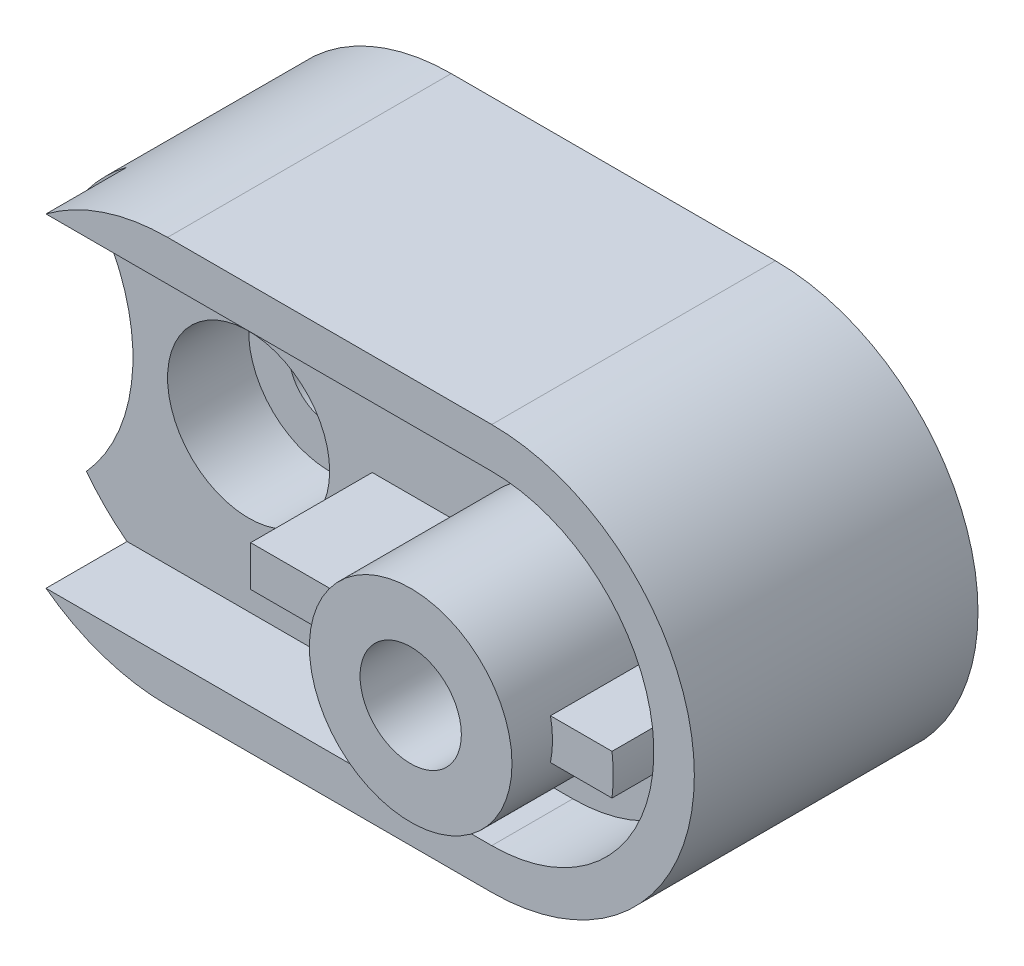
ISO-10303-21;
HEADER;
FILE_DESCRIPTION(('STEP AP214'),'2;1');
FILE_NAME('part.step','',(''),(''),'','','');
FILE_SCHEMA(('AUTOMOTIVE_DESIGN { 1 0 10303 214 1 1 1 1 }'));
ENDSEC;
DATA;
#1=APPLICATION_CONTEXT('core data for automotive mechanical design processes');
#2=APPLICATION_PROTOCOL_DEFINITION('international standard','automotive_design',2000,#1);
#3=PRODUCT_CONTEXT('',#1,'mechanical');
#4=PRODUCT('Part','Part','',(#3));
#5=PRODUCT_RELATED_PRODUCT_CATEGORY('part','',(#4));
#6=PRODUCT_DEFINITION_FORMATION('','',#4);
#7=PRODUCT_DEFINITION_CONTEXT('part definition',#1,'design');
#8=PRODUCT_DEFINITION('design','',#6,#7);
#9=PRODUCT_DEFINITION_SHAPE('','',#8);
#10=(LENGTH_UNIT() NAMED_UNIT(*) SI_UNIT(.MILLI.,.METRE.));
#11=(NAMED_UNIT(*) PLANE_ANGLE_UNIT() SI_UNIT($,.RADIAN.));
#12=(NAMED_UNIT(*) SI_UNIT($,.STERADIAN.) SOLID_ANGLE_UNIT());
#13=UNCERTAINTY_MEASURE_WITH_UNIT(LENGTH_MEASURE(1.E-05),#10,'distance_accuracy_value','');
#14=(GEOMETRIC_REPRESENTATION_CONTEXT(3) GLOBAL_UNCERTAINTY_ASSIGNED_CONTEXT((#13)) GLOBAL_UNIT_ASSIGNED_CONTEXT((#10,
#11,#12)) REPRESENTATION_CONTEXT('',''));
#15=CARTESIAN_POINT('',(0.,0.,0.));
#16=DIRECTION('',(0.,0.,1.));
#17=DIRECTION('',(1.,0.,0.));
#18=AXIS2_PLACEMENT_3D('',#15,#16,#17);
#19=CARTESIAN_POINT('',(0.,0.,50.));
#20=DIRECTION('',(0.,0.,1.));
#21=DIRECTION('',(1.,0.,0.));
#22=AXIS2_PLACEMENT_3D('',#19,#20,#21);
#23=PLANE('',#22);
#24=CARTESIAN_POINT('',(50.,50.,50.));
#25=DIRECTION('',(0.,0.,1.));
#26=DIRECTION('',(1.,0.,0.));
#27=AXIS2_PLACEMENT_3D('',#24,#25,#26);
#28=CIRCLE('',#27,20.);
#29=CARTESIAN_POINT('',(70.,50.,50.));
#30=VERTEX_POINT('',#29);
#31=EDGE_CURVE('E230',#30,#30,#28,.T.);
#32=ORIENTED_EDGE('',*,*,#31,.F.);
#33=EDGE_LOOP('',(#32));
#34=FACE_BOUND('',#33,.T.);
#35=CARTESIAN_POINT('',(130.,50.,50.));
#36=DIRECTION('',(0.,0.,1.));
#37=DIRECTION('',(1.,0.,0.));
#38=AXIS2_PLACEMENT_3D('',#35,#36,#37);
#39=CIRCLE('',#38,40.);
#40=CARTESIAN_POINT('',(169.686269665969,45.,50.));
#41=VERTEX_POINT('',#40);
#42=CARTESIAN_POINT('',(130.,9.99999999999999,50.));
#43=VERTEX_POINT('',#42);
#44=EDGE_CURVE('E249',#41,#43,#39,.F.);
#45=ORIENTED_EDGE('',*,*,#44,.F.);
#46=DIRECTION('',(1.,0.,0.));
#47=VECTOR('',#46,1.);
#48=CARTESIAN_POINT('',(0.,45.,50.));
#49=LINE('',#48,#47);
#50=CARTESIAN_POINT('',(154.494897427832,45.,50.));
#51=VERTEX_POINT('',#50);
#52=EDGE_CURVE('E193',#51,#41,#49,.T.);
#53=ORIENTED_EDGE('',*,*,#52,.F.);
#54=CARTESIAN_POINT('',(130.,50.,50.));
#55=DIRECTION('',(0.,0.,1.));
#56=DIRECTION('',(1.,0.,0.));
#57=AXIS2_PLACEMENT_3D('',#54,#55,#56);
#58=CIRCLE('',#57,25.);
#59=CARTESIAN_POINT('',(105.505102572168,45.,50.));
#60=VERTEX_POINT('',#59);
#61=EDGE_CURVE('E244',#60,#51,#58,.T.);
#62=ORIENTED_EDGE('',*,*,#61,.F.);
#63=DIRECTION('',(-1.,0.,0.));
#64=VECTOR('',#63,1.);
#65=CARTESIAN_POINT('',(0.,45.,50.));
#66=LINE('',#65,#64);
#67=CARTESIAN_POINT('',(80.5051025721682,45.,50.));
#68=VERTEX_POINT('',#67);
#69=EDGE_CURVE('E205',#60,#68,#66,.T.);
#70=ORIENTED_EDGE('',*,*,#69,.T.);
#71=DIRECTION('',(0.,-1.,0.));
#72=VECTOR('',#71,1.);
#73=CARTESIAN_POINT('',(80.5051025721682,0.,50.));
#74=LINE('',#73,#72);
#75=CARTESIAN_POINT('',(80.5051025721682,55.,50.));
#76=VERTEX_POINT('',#75);
#77=EDGE_CURVE('E212',#76,#68,#74,.T.);
#78=ORIENTED_EDGE('',*,*,#77,.F.);
#79=DIRECTION('',(-1.,0.,0.));
#80=VECTOR('',#79,1.);
#81=CARTESIAN_POINT('',(0.,55.,50.));
#82=LINE('',#81,#80);
#83=CARTESIAN_POINT('',(105.505102572168,55.,50.));
#84=VERTEX_POINT('',#83);
#85=EDGE_CURVE('E201',#84,#76,#82,.T.);
#86=ORIENTED_EDGE('',*,*,#85,.F.);
#87=CARTESIAN_POINT('',(154.494897427832,55.,50.));
#88=VERTEX_POINT('',#87);
#89=EDGE_CURVE('E239',#88,#84,#58,.T.);
#90=ORIENTED_EDGE('',*,*,#89,.F.);
#91=DIRECTION('',(1.,0.,0.));
#92=VECTOR('',#91,1.);
#93=CARTESIAN_POINT('',(0.,55.,50.));
#94=LINE('',#93,#92);
#95=CARTESIAN_POINT('',(169.686269665969,55.,50.));
#96=VERTEX_POINT('',#95);
#97=EDGE_CURVE('E195',#88,#96,#94,.T.);
#98=ORIENTED_EDGE('',*,*,#97,.T.);
#99=CARTESIAN_POINT('',(130.,90.,50.));
#100=VERTEX_POINT('',#99);
#101=EDGE_CURVE('E246',#100,#96,#39,.F.);
#102=ORIENTED_EDGE('',*,*,#101,.F.);
#103=DIRECTION('',(-1.,0.,0.));
#104=VECTOR('',#103,1.);
#105=CARTESIAN_POINT('',(0.,90.,50.));
#106=LINE('',#105,#104);
#107=CARTESIAN_POINT('',(20.,90.,50.));
#108=VERTEX_POINT('',#107);
#109=EDGE_CURVE('E248',#100,#108,#106,.T.);
#110=ORIENTED_EDGE('',*,*,#109,.T.);
#111=CARTESIAN_POINT('',(50.,50.,50.));
#112=DIRECTION('',(0.,0.,1.));
#113=DIRECTION('',(1.,0.,0.));
#114=AXIS2_PLACEMENT_3D('',#111,#112,#113);
#115=CIRCLE('',#114,50.);
#116=CARTESIAN_POINT('',(9.99999999999999,80.,50.));
#117=VERTEX_POINT('',#116);
#118=EDGE_CURVE('E252',#108,#117,#115,.T.);
#119=ORIENTED_EDGE('',*,*,#118,.T.);
#120=CARTESIAN_POINT('',(-23.5410196624968,50.,50.));
#121=DIRECTION('',(0.,0.,1.));
#122=DIRECTION('',(1.,0.,0.));
#123=AXIS2_PLACEMENT_3D('',#120,#121,#122);
#124=CIRCLE('',#123,45.);
#125=CARTESIAN_POINT('',(9.99999999999998,20.,50.));
#126=VERTEX_POINT('',#125);
#127=EDGE_CURVE('E254',#117,#126,#124,.F.);
#128=ORIENTED_EDGE('',*,*,#127,.T.);
#129=CARTESIAN_POINT('',(50.,50.,50.));
#130=DIRECTION('',(0.,0.,1.));
#131=DIRECTION('',(1.,0.,0.));
#132=AXIS2_PLACEMENT_3D('',#129,#130,#131);
#133=CIRCLE('',#132,50.);
#134=CARTESIAN_POINT('',(20.,9.99999999999999,50.));
#135=VERTEX_POINT('',#134);
#136=EDGE_CURVE('E256',#126,#135,#133,.T.);
#137=ORIENTED_EDGE('',*,*,#136,.T.);
#138=DIRECTION('',(-1.,0.,0.));
#139=VECTOR('',#138,1.);
#140=CARTESIAN_POINT('',(0.,9.99999999999999,50.));
#141=LINE('',#140,#139);
#142=EDGE_CURVE('E259',#43,#135,#141,.T.);
#143=ORIENTED_EDGE('',*,*,#142,.F.);
#144=EDGE_LOOP('',(#45,#53,#62,#70,#78,#86,#90,#98,#102,#110,#119,#128,#137,#143));
#145=FACE_BOUND('',#144,.T.);
#146=ADVANCED_FACE('F35',(#34,#145),#23,.T.);
#147=CARTESIAN_POINT('',(130.,50.,90.));
#148=DIRECTION('',(0.,0.,-1.));
#149=DIRECTION('',(-1.,0.,0.));
#150=AXIS2_PLACEMENT_3D('',#147,#148,#149);
#151=CYLINDRICAL_SURFACE('',#150,25.);
#152=CARTESIAN_POINT('',(130.,50.,90.));
#153=DIRECTION('',(0.,0.,1.));
#154=DIRECTION('',(1.,0.,0.));
#155=AXIS2_PLACEMENT_3D('',#152,#153,#154);
#156=CIRCLE('',#155,25.);
#157=CARTESIAN_POINT('',(155.,50.,90.));
#158=VERTEX_POINT('',#157);
#159=EDGE_CURVE('E240',#158,#158,#156,.T.);
#160=ORIENTED_EDGE('',*,*,#159,.F.);
#161=EDGE_LOOP('',(#160));
#162=FACE_BOUND('',#161,.T.);
#163=DIRECTION('',(0.,0.,-1.));
#164=VECTOR('',#163,1.);
#165=CARTESIAN_POINT('',(154.494897427832,45.,80.));
#166=LINE('',#165,#164);
#167=CARTESIAN_POINT('',(154.494897427832,45.,80.));
#168=VERTEX_POINT('',#167);
#169=EDGE_CURVE('E55',#168,#51,#166,.T.);
#170=ORIENTED_EDGE('',*,*,#169,.F.);
#171=CARTESIAN_POINT('',(130.,50.,80.));
#172=DIRECTION('',(0.,0.,1.));
#173=DIRECTION('',(1.,0.,0.));
#174=AXIS2_PLACEMENT_3D('',#171,#172,#173);
#175=CIRCLE('',#174,25.);
#176=CARTESIAN_POINT('',(154.494897427832,55.,80.));
#177=VERTEX_POINT('',#176);
#178=EDGE_CURVE('E50',#177,#168,#175,.F.);
#179=ORIENTED_EDGE('',*,*,#178,.F.);
#180=DIRECTION('',(0.,0.,-1.));
#181=VECTOR('',#180,1.);
#182=CARTESIAN_POINT('',(154.494897427832,55.,80.));
#183=LINE('',#182,#181);
#184=EDGE_CURVE('E189',#177,#88,#183,.T.);
#185=ORIENTED_EDGE('',*,*,#184,.T.);
#186=ORIENTED_EDGE('',*,*,#89,.T.);
#187=DIRECTION('',(0.,0.,-1.));
#188=VECTOR('',#187,1.);
#189=CARTESIAN_POINT('',(105.505102572168,55.,80.));
#190=LINE('',#189,#188);
#191=CARTESIAN_POINT('',(105.505102572168,55.,80.));
#192=VERTEX_POINT('',#191);
#193=EDGE_CURVE('E224',#192,#84,#190,.T.);
#194=ORIENTED_EDGE('',*,*,#193,.F.);
#195=CARTESIAN_POINT('',(130.,50.,80.));
#196=DIRECTION('',(0.,0.,1.));
#197=DIRECTION('',(1.,0.,0.));
#198=AXIS2_PLACEMENT_3D('',#195,#196,#197);
#199=CIRCLE('',#198,25.);
#200=CARTESIAN_POINT('',(105.505102572168,45.,80.));
#201=VERTEX_POINT('',#200);
#202=EDGE_CURVE('E331',#192,#201,#199,.T.);
#203=ORIENTED_EDGE('',*,*,#202,.T.);
#204=DIRECTION('',(0.,0.,-1.));
#205=VECTOR('',#204,1.);
#206=CARTESIAN_POINT('',(105.505102572168,45.,80.));
#207=LINE('',#206,#205);
#208=EDGE_CURVE('E210',#201,#60,#207,.T.);
#209=ORIENTED_EDGE('',*,*,#208,.T.);
#210=ORIENTED_EDGE('',*,*,#61,.T.);
#211=EDGE_LOOP('',(#170,#179,#185,#186,#194,#203,#209,#210));
#212=FACE_BOUND('',#211,.T.);
#213=ADVANCED_FACE('F390',(#162,#212),#151,.T.);
#214=CARTESIAN_POINT('',(130.,50.,50.));
#215=DIRECTION('',(0.,0.,1.));
#216=DIRECTION('',(1.,0.,0.));
#217=AXIS2_PLACEMENT_3D('',#214,#215,#216);
#218=CYLINDRICAL_SURFACE('',#217,40.);
#219=CARTESIAN_POINT('',(130.,50.,70.));
#220=DIRECTION('',(0.,0.,1.));
#221=DIRECTION('',(1.,0.,0.));
#222=AXIS2_PLACEMENT_3D('',#219,#220,#221);
#223=CIRCLE('',#222,40.);
#224=CARTESIAN_POINT('',(169.686269665969,45.,70.));
#225=VERTEX_POINT('',#224);
#226=CARTESIAN_POINT('',(130.,9.99999999999999,70.));
#227=VERTEX_POINT('',#226);
#228=EDGE_CURVE('E243',#225,#227,#223,.F.);
#229=ORIENTED_EDGE('',*,*,#228,.F.);
#230=DIRECTION('',(0.,0.,1.));
#231=VECTOR('',#230,1.);
#232=CARTESIAN_POINT('',(169.686269665969,45.,50.));
#233=LINE('',#232,#231);
#234=EDGE_CURVE('E11',#225,#41,#233,.F.);
#235=ORIENTED_EDGE('',*,*,#234,.T.);
#236=ORIENTED_EDGE('',*,*,#44,.T.);
#237=DIRECTION('',(0.,0.,1.));
#238=VECTOR('',#237,1.);
#239=CARTESIAN_POINT('',(130.,9.99999999999999,50.));
#240=LINE('',#239,#238);
#241=EDGE_CURVE('E274',#43,#227,#240,.T.);
#242=ORIENTED_EDGE('',*,*,#241,.T.);
#243=EDGE_LOOP('',(#229,#235,#236,#242));
#244=FACE_BOUND('',#243,.T.);
#245=ADVANCED_FACE('F357',(#244),#218,.F.);
#246=CARTESIAN_POINT('',(50.,50.,-36.));
#247=DIRECTION('',(0.,0.,1.));
#248=DIRECTION('',(1.,0.,0.));
#249=AXIS2_PLACEMENT_3D('',#246,#247,#248);
#250=CYLINDRICAL_SURFACE('',#249,10.);
#251=CARTESIAN_POINT('',(50.,50.,0.));
#252=DIRECTION('',(0.,0.,-1.));
#253=DIRECTION('',(-1.,0.,0.));
#254=AXIS2_PLACEMENT_3D('',#251,#252,#253);
#255=CIRCLE('',#254,10.);
#256=CARTESIAN_POINT('',(40.,50.,0.));
#257=VERTEX_POINT('',#256);
#258=EDGE_CURVE('E277',#257,#257,#255,.T.);
#259=ORIENTED_EDGE('',*,*,#258,.T.);
#260=EDGE_LOOP('',(#259));
#261=FACE_BOUND('',#260,.T.);
#262=CARTESIAN_POINT('',(50.,50.,30.));
#263=DIRECTION('',(0.,0.,1.));
#264=DIRECTION('',(1.,0.,0.));
#265=AXIS2_PLACEMENT_3D('',#262,#263,#264);
#266=CIRCLE('',#265,10.);
#267=CARTESIAN_POINT('',(60.,50.,30.));
#268=VERTEX_POINT('',#267);
#269=EDGE_CURVE('E227',#268,#268,#266,.T.);
#270=ORIENTED_EDGE('',*,*,#269,.T.);
#271=EDGE_LOOP('',(#270));
#272=FACE_BOUND('',#271,.T.);
#273=ADVANCED_FACE('F438',(#261,#272),#250,.F.);
#274=CARTESIAN_POINT('',(0.,0.,70.));
#275=DIRECTION('',(0.,0.,-1.));
#276=DIRECTION('',(-1.,0.,0.));
#277=AXIS2_PLACEMENT_3D('',#274,#275,#276);
#278=PLANE('',#277);
#279=DIRECTION('',(-1.,0.,0.));
#280=VECTOR('',#279,1.);
#281=CARTESIAN_POINT('',(0.,9.99999999999999,70.));
#282=LINE('',#281,#280);
#283=CARTESIAN_POINT('',(20.,9.99999999999999,70.));
#284=VERTEX_POINT('',#283);
#285=EDGE_CURVE('E271',#227,#284,#282,.T.);
#286=ORIENTED_EDGE('',*,*,#285,.T.);
#287=CARTESIAN_POINT('',(50.,50.,70.));
#288=DIRECTION('',(0.,0.,1.));
#289=DIRECTION('',(1.,0.,0.));
#290=AXIS2_PLACEMENT_3D('',#287,#288,#289);
#291=CIRCLE('',#290,50.);
#292=CARTESIAN_POINT('',(50.,0.,70.));
#293=VERTEX_POINT('',#292);
#294=EDGE_CURVE('E315',#284,#293,#291,.T.);
#295=ORIENTED_EDGE('',*,*,#294,.T.);
#296=DIRECTION('',(1.,0.,0.));
#297=VECTOR('',#296,1.);
#298=CARTESIAN_POINT('',(0.,0.,70.));
#299=LINE('',#298,#297);
#300=CARTESIAN_POINT('',(130.,0.,70.));
#301=VERTEX_POINT('',#300);
#302=EDGE_CURVE('E325',#293,#301,#299,.T.);
#303=ORIENTED_EDGE('',*,*,#302,.T.);
#304=CARTESIAN_POINT('',(130.,50.,70.));
#305=DIRECTION('',(0.,0.,1.));
#306=DIRECTION('',(1.,0.,0.));
#307=AXIS2_PLACEMENT_3D('',#304,#305,#306);
#308=CIRCLE('',#307,50.);
#309=CARTESIAN_POINT('',(130.,100.,70.));
#310=VERTEX_POINT('',#309);
#311=EDGE_CURVE('E304',#310,#301,#308,.F.);
#312=ORIENTED_EDGE('',*,*,#311,.F.);
#313=DIRECTION('',(-1.,0.,0.));
#314=VECTOR('',#313,1.);
#315=CARTESIAN_POINT('',(0.,100.,70.));
#316=LINE('',#315,#314);
#317=CARTESIAN_POINT('',(50.,100.,70.));
#318=VERTEX_POINT('',#317);
#319=EDGE_CURVE('E328',#310,#318,#316,.T.);
#320=ORIENTED_EDGE('',*,*,#319,.T.);
#321=CARTESIAN_POINT('',(20.,90.,70.));
#322=VERTEX_POINT('',#321);
#323=EDGE_CURVE('E319',#318,#322,#291,.T.);
#324=ORIENTED_EDGE('',*,*,#323,.T.);
#325=DIRECTION('',(-1.,0.,0.));
#326=VECTOR('',#325,1.);
#327=CARTESIAN_POINT('',(0.,90.,70.));
#328=LINE('',#327,#326);
#329=CARTESIAN_POINT('',(130.,90.,70.));
#330=VERTEX_POINT('',#329);
#331=EDGE_CURVE('E268',#330,#322,#328,.T.);
#332=ORIENTED_EDGE('',*,*,#331,.F.);
#333=CARTESIAN_POINT('',(169.686269665969,55.,70.));
#334=VERTEX_POINT('',#333);
#335=EDGE_CURVE('E265',#330,#334,#223,.F.);
#336=ORIENTED_EDGE('',*,*,#335,.T.);
#337=EDGE_CURVE('E269',#334,#225,#223,.F.);
#338=ORIENTED_EDGE('',*,*,#337,.T.);
#339=ORIENTED_EDGE('',*,*,#228,.T.);
#340=EDGE_LOOP('',(#286,#295,#303,#312,#320,#324,#332,#336,#338,#339));
#341=FACE_BOUND('',#340,.T.);
#342=ADVANCED_FACE('F349',(#341),#278,.F.);
#343=CARTESIAN_POINT('',(50.,50.,0.));
#344=DIRECTION('',(0.,0.,1.));
#345=DIRECTION('',(1.,0.,0.));
#346=AXIS2_PLACEMENT_3D('',#343,#344,#345);
#347=CYLINDRICAL_SURFACE('',#346,50.);
#348=ORIENTED_EDGE('',*,*,#294,.F.);
#349=DIRECTION('',(0.,0.,1.));
#350=VECTOR('',#349,1.);
#351=CARTESIAN_POINT('',(20.,9.99999999999999,50.));
#352=LINE('',#351,#350);
#353=EDGE_CURVE('E278',#135,#284,#352,.T.);
#354=ORIENTED_EDGE('',*,*,#353,.F.);
#355=ORIENTED_EDGE('',*,*,#136,.F.);
#356=DIRECTION('',(0.,0.,1.));
#357=VECTOR('',#356,1.);
#358=CARTESIAN_POINT('',(9.99999999999998,20.,20.));
#359=LINE('',#358,#357);
#360=CARTESIAN_POINT('',(9.99999999999998,20.,20.));
#361=VERTEX_POINT('',#360);
#362=EDGE_CURVE('E293',#361,#126,#359,.T.);
#363=ORIENTED_EDGE('',*,*,#362,.F.);
#364=CARTESIAN_POINT('',(50.,50.,20.));
#365=DIRECTION('',(0.,0.,1.));
#366=DIRECTION('',(1.,0.,0.));
#367=AXIS2_PLACEMENT_3D('',#364,#365,#366);
#368=CIRCLE('',#367,50.);
#369=CARTESIAN_POINT('',(9.99999999999999,80.,20.));
#370=VERTEX_POINT('',#369);
#371=EDGE_CURVE('E286',#370,#361,#368,.T.);
#372=ORIENTED_EDGE('',*,*,#371,.F.);
#373=DIRECTION('',(0.,0.,1.));
#374=VECTOR('',#373,1.);
#375=CARTESIAN_POINT('',(9.99999999999999,80.,20.));
#376=LINE('',#375,#374);
#377=EDGE_CURVE('E292',#370,#117,#376,.T.);
#378=ORIENTED_EDGE('',*,*,#377,.T.);
#379=ORIENTED_EDGE('',*,*,#118,.F.);
#380=DIRECTION('',(0.,0.,1.));
#381=VECTOR('',#380,1.);
#382=CARTESIAN_POINT('',(20.,90.,50.));
#383=LINE('',#382,#381);
#384=EDGE_CURVE('E280',#108,#322,#383,.T.);
#385=ORIENTED_EDGE('',*,*,#384,.T.);
#386=ORIENTED_EDGE('',*,*,#323,.F.);
#387=DIRECTION('',(0.,0.,1.));
#388=VECTOR('',#387,1.);
#389=CARTESIAN_POINT('',(50.,100.,0.));
#390=LINE('',#389,#388);
#391=CARTESIAN_POINT('',(50.,100.,0.));
#392=VERTEX_POINT('',#391);
#393=EDGE_CURVE('E318',#392,#318,#390,.T.);
#394=ORIENTED_EDGE('',*,*,#393,.F.);
#395=CARTESIAN_POINT('',(50.,50.,0.));
#396=DIRECTION('',(0.,0.,1.));
#397=DIRECTION('',(1.,0.,0.));
#398=AXIS2_PLACEMENT_3D('',#395,#396,#397);
#399=CIRCLE('',#398,50.);
#400=CARTESIAN_POINT('',(50.,0.,0.));
#401=VERTEX_POINT('',#400);
#402=EDGE_CURVE('E316',#392,#401,#399,.T.);
#403=ORIENTED_EDGE('',*,*,#402,.T.);
#404=DIRECTION('',(0.,0.,1.));
#405=VECTOR('',#404,1.);
#406=CARTESIAN_POINT('',(50.,0.,0.));
#407=LINE('',#406,#405);
#408=EDGE_CURVE('E312',#401,#293,#407,.T.);
#409=ORIENTED_EDGE('',*,*,#408,.T.);
#410=EDGE_LOOP('',(#348,#354,#355,#363,#372,#378,#379,#385,#386,#394,#403,#409));
#411=FACE_BOUND('',#410,.T.);
#412=ADVANCED_FACE('F365',(#411),#347,.T.);
#413=CARTESIAN_POINT('',(-23.5410196624968,50.,20.));
#414=DIRECTION('',(0.,0.,1.));
#415=DIRECTION('',(1.,0.,0.));
#416=AXIS2_PLACEMENT_3D('',#413,#414,#415);
#417=CYLINDRICAL_SURFACE('',#416,45.);
#418=ORIENTED_EDGE('',*,*,#362,.T.);
#419=ORIENTED_EDGE('',*,*,#127,.F.);
#420=ORIENTED_EDGE('',*,*,#377,.F.);
#421=CARTESIAN_POINT('',(-23.5410196624968,50.,20.));
#422=DIRECTION('',(0.,0.,1.));
#423=DIRECTION('',(1.,0.,0.));
#424=AXIS2_PLACEMENT_3D('',#421,#422,#423);
#425=CIRCLE('',#424,45.);
#426=EDGE_CURVE('E284',#370,#361,#425,.F.);
#427=ORIENTED_EDGE('',*,*,#426,.T.);
#428=EDGE_LOOP('',(#418,#419,#420,#427));
#429=FACE_BOUND('',#428,.T.);
#430=ADVANCED_FACE('F445',(#429),#417,.F.);
#431=CARTESIAN_POINT('',(9.99999999999997,50.,0.));
#432=DIRECTION('',(0.,0.,1.));
#433=DIRECTION('',(1.,0.,0.));
#434=AXIS2_PLACEMENT_3D('',#431,#432,#433);
#435=CYLINDRICAL_SURFACE('',#434,5.);
#436=CARTESIAN_POINT('',(9.99999999999997,50.,0.));
#437=DIRECTION('',(0.,0.,1.));
#438=DIRECTION('',(1.,0.,0.));
#439=AXIS2_PLACEMENT_3D('',#436,#437,#438);
#440=CIRCLE('',#439,5.);
#441=CARTESIAN_POINT('',(15.,50.,0.));
#442=VERTEX_POINT('',#441);
#443=EDGE_CURVE('E296',#442,#442,#440,.T.);
#444=ORIENTED_EDGE('',*,*,#443,.F.);
#445=EDGE_LOOP('',(#444));
#446=FACE_BOUND('',#445,.T.);
#447=CARTESIAN_POINT('',(9.99999999999997,50.,20.));
#448=DIRECTION('',(0.,0.,1.));
#449=DIRECTION('',(1.,0.,0.));
#450=AXIS2_PLACEMENT_3D('',#447,#448,#449);
#451=CIRCLE('',#450,5.);
#452=CARTESIAN_POINT('',(15.,50.,20.));
#453=VERTEX_POINT('',#452);
#454=EDGE_CURVE('E289',#453,#453,#451,.F.);
#455=ORIENTED_EDGE('',*,*,#454,.F.);
#456=EDGE_LOOP('',(#455));
#457=FACE_BOUND('',#456,.T.);
#458=ADVANCED_FACE('F448',(#446,#457),#435,.F.);
#459=CARTESIAN_POINT('',(0.,0.,70.));
#460=DIRECTION('',(0.,1.,0.));
#461=DIRECTION('',(0.,0.,1.));
#462=AXIS2_PLACEMENT_3D('',#459,#460,#461);
#463=PLANE('',#462);
#464=DIRECTION('',(0.,0.,1.));
#465=VECTOR('',#464,1.);
#466=CARTESIAN_POINT('',(130.,0.,0.));
#467=LINE('',#466,#465);
#468=CARTESIAN_POINT('',(130.,0.,0.));
#469=VERTEX_POINT('',#468);
#470=EDGE_CURVE('E308',#469,#301,#467,.T.);
#471=ORIENTED_EDGE('',*,*,#470,.T.);
#472=ORIENTED_EDGE('',*,*,#302,.F.);
#473=ORIENTED_EDGE('',*,*,#408,.F.);
#474=DIRECTION('',(1.,0.,0.));
#475=VECTOR('',#474,1.);
#476=CARTESIAN_POINT('',(0.,0.,0.));
#477=LINE('',#476,#475);
#478=EDGE_CURVE('E324',#401,#469,#477,.T.);
#479=ORIENTED_EDGE('',*,*,#478,.T.);
#480=EDGE_LOOP('',(#471,#472,#473,#479));
#481=FACE_BOUND('',#480,.T.);
#482=ADVANCED_FACE('F37',(#481),#463,.F.);
#483=CARTESIAN_POINT('',(0.,0.,0.));
#484=DIRECTION('',(0.,0.,-1.));
#485=DIRECTION('',(-1.,0.,0.));
#486=AXIS2_PLACEMENT_3D('',#483,#484,#485);
#487=PLANE('',#486);
#488=ORIENTED_EDGE('',*,*,#258,.F.);
#489=EDGE_LOOP('',(#488));
#490=FACE_BOUND('',#489,.T.);
#491=ORIENTED_EDGE('',*,*,#443,.T.);
#492=EDGE_LOOP('',(#491));
#493=FACE_BOUND('',#492,.T.);
#494=DIRECTION('',(-1.,0.,0.));
#495=VECTOR('',#494,1.);
#496=CARTESIAN_POINT('',(0.,100.,0.));
#497=LINE('',#496,#495);
#498=CARTESIAN_POINT('',(130.,100.,0.));
#499=VERTEX_POINT('',#498);
#500=EDGE_CURVE('E329',#499,#392,#497,.T.);
#501=ORIENTED_EDGE('',*,*,#500,.F.);
#502=CARTESIAN_POINT('',(130.,50.,0.));
#503=DIRECTION('',(0.,0.,1.));
#504=DIRECTION('',(1.,0.,0.));
#505=AXIS2_PLACEMENT_3D('',#502,#503,#504);
#506=CIRCLE('',#505,50.);
#507=EDGE_CURVE('E305',#499,#469,#506,.F.);
#508=ORIENTED_EDGE('',*,*,#507,.T.);
#509=ORIENTED_EDGE('',*,*,#478,.F.);
#510=ORIENTED_EDGE('',*,*,#402,.F.);
#511=EDGE_LOOP('',(#501,#508,#509,#510));
#512=FACE_BOUND('',#511,.T.);
#513=ADVANCED_FACE('F375',(#490,#493,#512),#487,.T.);
#514=CARTESIAN_POINT('',(0.,100.,70.));
#515=DIRECTION('',(0.,-1.,0.));
#516=DIRECTION('',(0.,0.,-1.));
#517=AXIS2_PLACEMENT_3D('',#514,#515,#516);
#518=PLANE('',#517);
#519=ORIENTED_EDGE('',*,*,#319,.F.);
#520=DIRECTION('',(0.,0.,1.));
#521=VECTOR('',#520,1.);
#522=CARTESIAN_POINT('',(130.,100.,0.));
#523=LINE('',#522,#521);
#524=EDGE_CURVE('E301',#499,#310,#523,.T.);
#525=ORIENTED_EDGE('',*,*,#524,.F.);
#526=ORIENTED_EDGE('',*,*,#500,.T.);
#527=ORIENTED_EDGE('',*,*,#393,.T.);
#528=EDGE_LOOP('',(#519,#525,#526,#527));
#529=FACE_BOUND('',#528,.T.);
#530=ADVANCED_FACE('F380',(#529),#518,.F.);
#531=CARTESIAN_POINT('',(130.,50.,0.));
#532=DIRECTION('',(0.,0.,1.));
#533=DIRECTION('',(1.,0.,0.));
#534=AXIS2_PLACEMENT_3D('',#531,#532,#533);
#535=CYLINDRICAL_SURFACE('',#534,50.);
#536=ORIENTED_EDGE('',*,*,#311,.T.);
#537=ORIENTED_EDGE('',*,*,#470,.F.);
#538=ORIENTED_EDGE('',*,*,#507,.F.);
#539=ORIENTED_EDGE('',*,*,#524,.T.);
#540=EDGE_LOOP('',(#536,#537,#538,#539));
#541=FACE_BOUND('',#540,.T.);
#542=ADVANCED_FACE('F371',(#541),#535,.T.);
#543=CARTESIAN_POINT('',(0.,0.,20.));
#544=DIRECTION('',(0.,0.,1.));
#545=DIRECTION('',(1.,0.,0.));
#546=AXIS2_PLACEMENT_3D('',#543,#544,#545);
#547=PLANE('',#546);
#548=ORIENTED_EDGE('',*,*,#426,.F.);
#549=ORIENTED_EDGE('',*,*,#371,.T.);
#550=EDGE_LOOP('',(#548,#549));
#551=FACE_BOUND('',#550,.T.);
#552=ORIENTED_EDGE('',*,*,#454,.T.);
#553=EDGE_LOOP('',(#552));
#554=FACE_BOUND('',#553,.T.);
#555=ADVANCED_FACE('F431',(#551,#554),#547,.T.);
#556=DIRECTION('',(0.,0.,1.));
#557=VECTOR('',#556,1.);
#558=CARTESIAN_POINT('',(169.686269665969,55.,50.));
#559=LINE('',#558,#557);
#560=EDGE_CURVE('E43',#334,#96,#559,.F.);
#561=ORIENTED_EDGE('',*,*,#560,.F.);
#562=ORIENTED_EDGE('',*,*,#335,.F.);
#563=DIRECTION('',(0.,0.,1.));
#564=VECTOR('',#563,1.);
#565=CARTESIAN_POINT('',(130.,90.,50.));
#566=LINE('',#565,#564);
#567=EDGE_CURVE('E264',#100,#330,#566,.T.);
#568=ORIENTED_EDGE('',*,*,#567,.F.);
#569=ORIENTED_EDGE('',*,*,#101,.T.);
#570=EDGE_LOOP('',(#561,#562,#568,#569));
#571=FACE_BOUND('',#570,.T.);
#572=ADVANCED_FACE('F344',(#571),#218,.F.);
#573=CARTESIAN_POINT('',(0.,9.99999999999999,50.));
#574=DIRECTION('',(0.,1.,0.));
#575=DIRECTION('',(0.,0.,1.));
#576=AXIS2_PLACEMENT_3D('',#573,#574,#575);
#577=PLANE('',#576);
#578=ORIENTED_EDGE('',*,*,#285,.F.);
#579=ORIENTED_EDGE('',*,*,#241,.F.);
#580=ORIENTED_EDGE('',*,*,#142,.T.);
#581=ORIENTED_EDGE('',*,*,#353,.T.);
#582=EDGE_LOOP('',(#578,#579,#580,#581));
#583=FACE_BOUND('',#582,.T.);
#584=ADVANCED_FACE('F355',(#583),#577,.T.);
#585=CARTESIAN_POINT('',(0.,90.,50.));
#586=DIRECTION('',(0.,1.,0.));
#587=DIRECTION('',(0.,0.,1.));
#588=AXIS2_PLACEMENT_3D('',#585,#586,#587);
#589=PLANE('',#588);
#590=ORIENTED_EDGE('',*,*,#331,.T.);
#591=ORIENTED_EDGE('',*,*,#384,.F.);
#592=ORIENTED_EDGE('',*,*,#109,.F.);
#593=ORIENTED_EDGE('',*,*,#567,.T.);
#594=EDGE_LOOP('',(#590,#591,#592,#593));
#595=FACE_BOUND('',#594,.T.);
#596=ADVANCED_FACE('F385',(#595),#589,.F.);
#597=CARTESIAN_POINT('',(130.,50.,90.));
#598=DIRECTION('',(0.,0.,1.));
#599=DIRECTION('',(1.,0.,0.));
#600=AXIS2_PLACEMENT_3D('',#597,#598,#599);
#601=PLANE('',#600);
#602=ORIENTED_EDGE('',*,*,#159,.T.);
#603=EDGE_LOOP('',(#602));
#604=FACE_BOUND('',#603,.T.);
#605=CARTESIAN_POINT('',(130.,50.,90.));
#606=DIRECTION('',(0.,0.,1.));
#607=DIRECTION('',(1.,0.,0.));
#608=AXIS2_PLACEMENT_3D('',#605,#606,#607);
#609=CIRCLE('',#608,12.5);
#610=CARTESIAN_POINT('',(142.5,50.,90.));
#611=VERTEX_POINT('',#610);
#612=EDGE_CURVE('E234',#611,#611,#609,.T.);
#613=ORIENTED_EDGE('',*,*,#612,.F.);
#614=EDGE_LOOP('',(#613));
#615=FACE_BOUND('',#614,.T.);
#616=ADVANCED_FACE('F428',(#604,#615),#601,.T.);
#617=CARTESIAN_POINT('',(130.,50.,90.));
#618=DIRECTION('',(0.,0.,-1.));
#619=DIRECTION('',(-1.,0.,0.));
#620=AXIS2_PLACEMENT_3D('',#617,#618,#619);
#621=CYLINDRICAL_SURFACE('',#620,12.5);
#622=ORIENTED_EDGE('',*,*,#612,.T.);
#623=EDGE_LOOP('',(#622));
#624=FACE_BOUND('',#623,.T.);
#625=CARTESIAN_POINT('',(130.,50.,50.));
#626=DIRECTION('',(0.,0.,1.));
#627=DIRECTION('',(1.,0.,0.));
#628=AXIS2_PLACEMENT_3D('',#625,#626,#627);
#629=CIRCLE('',#628,12.5);
#630=CARTESIAN_POINT('',(142.5,50.,50.));
#631=VERTEX_POINT('',#630);
#632=EDGE_CURVE('E261',#631,#631,#629,.F.);
#633=ORIENTED_EDGE('',*,*,#632,.T.);
#634=EDGE_LOOP('',(#633));
#635=FACE_BOUND('',#634,.T.);
#636=ADVANCED_FACE('F436',(#624,#635),#621,.F.);
#637=CARTESIAN_POINT('',(130.,50.,50.));
#638=DIRECTION('',(0.,0.,1.));
#639=DIRECTION('',(1.,0.,0.));
#640=AXIS2_PLACEMENT_3D('',#637,#638,#639);
#641=CONICAL_SURFACE('',#640,12.5,1.02974425867665);
#642=CARTESIAN_POINT('',(130.,50.,42.4892422621555));
#643=VERTEX_POINT('',#642);
#644=VERTEX_LOOP('',#643);
#645=FACE_BOUND('',#644,.T.);
#646=ORIENTED_EDGE('',*,*,#632,.F.);
#647=EDGE_LOOP('',(#646));
#648=FACE_BOUND('',#647,.T.);
#649=ADVANCED_FACE('F432',(#645,#648),#641,.F.);
#650=CARTESIAN_POINT('',(50.,50.,30.));
#651=DIRECTION('',(0.,0.,1.));
#652=DIRECTION('',(1.,0.,0.));
#653=AXIS2_PLACEMENT_3D('',#650,#651,#652);
#654=CYLINDRICAL_SURFACE('',#653,20.);
#655=CARTESIAN_POINT('',(50.,50.,30.));
#656=DIRECTION('',(0.,0.,1.));
#657=DIRECTION('',(1.,0.,0.));
#658=AXIS2_PLACEMENT_3D('',#655,#656,#657);
#659=CIRCLE('',#658,20.);
#660=CARTESIAN_POINT('',(70.,50.,30.));
#661=VERTEX_POINT('',#660);
#662=EDGE_CURVE('E231',#661,#661,#659,.T.);
#663=ORIENTED_EDGE('',*,*,#662,.F.);
#664=EDGE_LOOP('',(#663));
#665=FACE_BOUND('',#664,.T.);
#666=ORIENTED_EDGE('',*,*,#31,.T.);
#667=EDGE_LOOP('',(#666));
#668=FACE_BOUND('',#667,.T.);
#669=ADVANCED_FACE('F435',(#665,#668),#654,.F.);
#670=CARTESIAN_POINT('',(50.,50.,30.));
#671=DIRECTION('',(0.,0.,1.));
#672=DIRECTION('',(1.,0.,0.));
#673=AXIS2_PLACEMENT_3D('',#670,#671,#672);
#674=PLANE('',#673);
#675=ORIENTED_EDGE('',*,*,#269,.F.);
#676=EDGE_LOOP('',(#675));
#677=FACE_BOUND('',#676,.T.);
#678=ORIENTED_EDGE('',*,*,#662,.T.);
#679=EDGE_LOOP('',(#678));
#680=FACE_BOUND('',#679,.T.);
#681=ADVANCED_FACE('F517',(#677,#680),#674,.T.);
#682=CARTESIAN_POINT('',(0.,0.,80.));
#683=DIRECTION('',(0.,0.,1.));
#684=DIRECTION('',(1.,0.,0.));
#685=AXIS2_PLACEMENT_3D('',#682,#683,#684);
#686=PLANE('',#685);
#687=ORIENTED_EDGE('',*,*,#202,.F.);
#688=DIRECTION('',(-1.,0.,0.));
#689=VECTOR('',#688,1.);
#690=CARTESIAN_POINT('',(0.,55.,80.));
#691=LINE('',#690,#689);
#692=CARTESIAN_POINT('',(80.5051025721682,55.,80.));
#693=VERTEX_POINT('',#692);
#694=EDGE_CURVE('E202',#192,#693,#691,.T.);
#695=ORIENTED_EDGE('',*,*,#694,.T.);
#696=DIRECTION('',(0.,-1.,0.));
#697=VECTOR('',#696,1.);
#698=CARTESIAN_POINT('',(80.5051025721682,0.,80.));
#699=LINE('',#698,#697);
#700=CARTESIAN_POINT('',(80.5051025721682,45.,80.));
#701=VERTEX_POINT('',#700);
#702=EDGE_CURVE('E204',#693,#701,#699,.T.);
#703=ORIENTED_EDGE('',*,*,#702,.T.);
#704=DIRECTION('',(-1.,0.,0.));
#705=VECTOR('',#704,1.);
#706=CARTESIAN_POINT('',(0.,45.,80.));
#707=LINE('',#706,#705);
#708=EDGE_CURVE('E207',#201,#701,#707,.T.);
#709=ORIENTED_EDGE('',*,*,#708,.F.);
#710=EDGE_LOOP('',(#687,#695,#703,#709));
#711=FACE_BOUND('',#710,.T.);
#712=ADVANCED_FACE('F397',(#711),#686,.T.);
#713=CARTESIAN_POINT('',(0.,55.,80.));
#714=DIRECTION('',(0.,-1.,0.));
#715=DIRECTION('',(1.,0.,0.));
#716=AXIS2_PLACEMENT_3D('',#713,#714,#715);
#717=PLANE('',#716);
#718=ORIENTED_EDGE('',*,*,#85,.T.);
#719=DIRECTION('',(0.,0.,-1.));
#720=VECTOR('',#719,1.);
#721=CARTESIAN_POINT('',(80.5051025721682,55.,80.));
#722=LINE('',#721,#720);
#723=EDGE_CURVE('E221',#693,#76,#722,.T.);
#724=ORIENTED_EDGE('',*,*,#723,.F.);
#725=ORIENTED_EDGE('',*,*,#694,.F.);
#726=ORIENTED_EDGE('',*,*,#193,.T.);
#727=EDGE_LOOP('',(#718,#724,#725,#726));
#728=FACE_BOUND('',#727,.T.);
#729=ADVANCED_FACE('F393',(#728),#717,.F.);
#730=CARTESIAN_POINT('',(80.5051025721682,0.,80.));
#731=DIRECTION('',(1.,0.,0.));
#732=DIRECTION('',(0.,0.,-1.));
#733=AXIS2_PLACEMENT_3D('',#730,#731,#732);
#734=PLANE('',#733);
#735=ORIENTED_EDGE('',*,*,#77,.T.);
#736=DIRECTION('',(0.,0.,-1.));
#737=VECTOR('',#736,1.);
#738=CARTESIAN_POINT('',(80.5051025721682,45.,80.));
#739=LINE('',#738,#737);
#740=EDGE_CURVE('E219',#701,#68,#739,.T.);
#741=ORIENTED_EDGE('',*,*,#740,.F.);
#742=ORIENTED_EDGE('',*,*,#702,.F.);
#743=ORIENTED_EDGE('',*,*,#723,.T.);
#744=EDGE_LOOP('',(#735,#741,#742,#743));
#745=FACE_BOUND('',#744,.T.);
#746=ADVANCED_FACE('F404',(#745),#734,.F.);
#747=CARTESIAN_POINT('',(0.,45.,80.));
#748=DIRECTION('',(0.,-1.,0.));
#749=DIRECTION('',(1.,0.,0.));
#750=AXIS2_PLACEMENT_3D('',#747,#748,#749);
#751=PLANE('',#750);
#752=ORIENTED_EDGE('',*,*,#69,.F.);
#753=ORIENTED_EDGE('',*,*,#208,.F.);
#754=ORIENTED_EDGE('',*,*,#708,.T.);
#755=ORIENTED_EDGE('',*,*,#740,.T.);
#756=EDGE_LOOP('',(#752,#753,#754,#755));
#757=FACE_BOUND('',#756,.T.);
#758=ADVANCED_FACE('F402',(#757),#751,.T.);
#759=CARTESIAN_POINT('',(130.,50.,80.));
#760=DIRECTION('',(0.,0.,-1.));
#761=DIRECTION('',(-1.,0.,0.));
#762=AXIS2_PLACEMENT_3D('',#759,#760,#761);
#763=CYLINDRICAL_SURFACE('',#762,40.);
#764=DIRECTION('',(0.,0.,-1.));
#765=VECTOR('',#764,1.);
#766=CARTESIAN_POINT('',(169.686269665969,45.,80.));
#767=LINE('',#766,#765);
#768=CARTESIAN_POINT('',(169.686269665969,45.,80.));
#769=VERTEX_POINT('',#768);
#770=EDGE_CURVE('E177',#769,#225,#767,.T.);
#771=ORIENTED_EDGE('',*,*,#770,.T.);
#772=ORIENTED_EDGE('',*,*,#337,.F.);
#773=DIRECTION('',(0.,0.,-1.));
#774=VECTOR('',#773,1.);
#775=CARTESIAN_POINT('',(169.686269665969,55.,80.));
#776=LINE('',#775,#774);
#777=CARTESIAN_POINT('',(169.686269665969,55.,80.));
#778=VERTEX_POINT('',#777);
#779=EDGE_CURVE('E182',#778,#334,#776,.T.);
#780=ORIENTED_EDGE('',*,*,#779,.F.);
#781=CARTESIAN_POINT('',(130.,50.,80.));
#782=DIRECTION('',(0.,0.,1.));
#783=DIRECTION('',(1.,0.,0.));
#784=AXIS2_PLACEMENT_3D('',#781,#782,#783);
#785=CIRCLE('',#784,40.);
#786=EDGE_CURVE('E171',#769,#778,#785,.T.);
#787=ORIENTED_EDGE('',*,*,#786,.F.);
#788=EDGE_LOOP('',(#771,#772,#780,#787));
#789=FACE_BOUND('',#788,.T.);
#790=ADVANCED_FACE('F184',(#789),#763,.T.);
#791=CARTESIAN_POINT('',(0.,45.,80.));
#792=DIRECTION('',(0.,1.,0.));
#793=DIRECTION('',(0.,0.,1.));
#794=AXIS2_PLACEMENT_3D('',#791,#792,#793);
#795=PLANE('',#794);
#796=ORIENTED_EDGE('',*,*,#52,.T.);
#797=ORIENTED_EDGE('',*,*,#234,.F.);
#798=ORIENTED_EDGE('',*,*,#770,.F.);
#799=DIRECTION('',(1.,0.,0.));
#800=VECTOR('',#799,1.);
#801=CARTESIAN_POINT('',(0.,45.,80.));
#802=LINE('',#801,#800);
#803=EDGE_CURVE('E166',#168,#769,#802,.T.);
#804=ORIENTED_EDGE('',*,*,#803,.F.);
#805=ORIENTED_EDGE('',*,*,#169,.T.);
#806=EDGE_LOOP('',(#796,#797,#798,#804,#805));
#807=FACE_BOUND('',#806,.T.);
#808=ADVANCED_FACE('F179',(#807),#795,.F.);
#809=CARTESIAN_POINT('',(0.,55.,80.));
#810=DIRECTION('',(0.,1.,0.));
#811=DIRECTION('',(0.,0.,1.));
#812=AXIS2_PLACEMENT_3D('',#809,#810,#811);
#813=PLANE('',#812);
#814=ORIENTED_EDGE('',*,*,#97,.F.);
#815=ORIENTED_EDGE('',*,*,#184,.F.);
#816=DIRECTION('',(1.,0.,0.));
#817=VECTOR('',#816,1.);
#818=CARTESIAN_POINT('',(0.,55.,80.));
#819=LINE('',#818,#817);
#820=EDGE_CURVE('E187',#177,#778,#819,.T.);
#821=ORIENTED_EDGE('',*,*,#820,.T.);
#822=ORIENTED_EDGE('',*,*,#779,.T.);
#823=ORIENTED_EDGE('',*,*,#560,.T.);
#824=EDGE_LOOP('',(#814,#815,#821,#822,#823));
#825=FACE_BOUND('',#824,.T.);
#826=ADVANCED_FACE('F341',(#825),#813,.T.);
#827=CARTESIAN_POINT('',(0.,0.,80.));
#828=DIRECTION('',(0.,0.,1.));
#829=DIRECTION('',(1.,0.,0.));
#830=AXIS2_PLACEMENT_3D('',#827,#828,#829);
#831=PLANE('',#830);
#832=ORIENTED_EDGE('',*,*,#178,.T.);
#833=ORIENTED_EDGE('',*,*,#803,.T.);
#834=ORIENTED_EDGE('',*,*,#786,.T.);
#835=ORIENTED_EDGE('',*,*,#820,.F.);
#836=EDGE_LOOP('',(#832,#833,#834,#835));
#837=FACE_BOUND('',#836,.T.);
#838=ADVANCED_FACE('F168',(#837),#831,.T.);
#839=CLOSED_SHELL('',(#146,#213,#245,#273,#342,#412,#430,#458,#482,#513,#530,#542,#555,#572,
#584,#596,#616,#636,#649,#669,#681,#712,#729,#746,#758,#790,#808,#826,#838));
#840=MANIFOLD_SOLID_BREP('B2',#839);
#841=ADVANCED_BREP_SHAPE_REPRESENTATION('',(#18,#840),#14);
#842=SHAPE_DEFINITION_REPRESENTATION(#9,#841);
ENDSEC;
END-ISO-10303-21;
